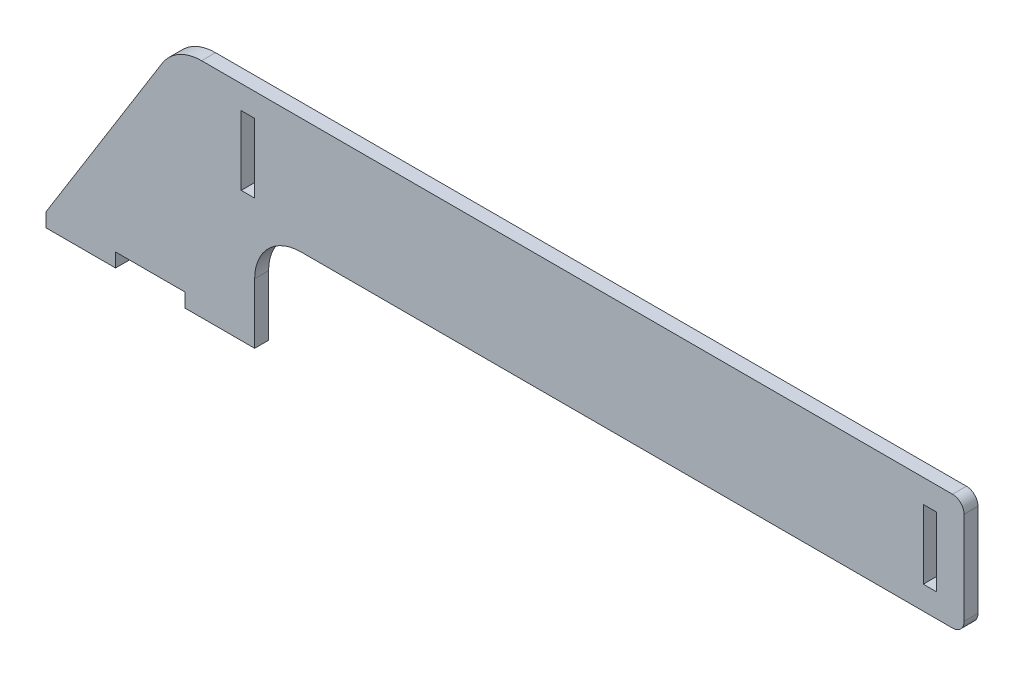
ISO-10303-21;
HEADER;
FILE_DESCRIPTION(('STEP AP214'),'2;1');
FILE_NAME('part.step','',(''),(''),'','','');
FILE_SCHEMA(('AUTOMOTIVE_DESIGN { 1 0 10303 214 1 1 1 1 }'));
ENDSEC;
DATA;
#1=APPLICATION_CONTEXT('core data for automotive mechanical design processes');
#2=APPLICATION_PROTOCOL_DEFINITION('international standard','automotive_design',2000,#1);
#3=PRODUCT_CONTEXT('',#1,'mechanical');
#4=PRODUCT('Part','Part','',(#3));
#5=PRODUCT_RELATED_PRODUCT_CATEGORY('part','',(#4));
#6=PRODUCT_DEFINITION_FORMATION('','',#4);
#7=PRODUCT_DEFINITION_CONTEXT('part definition',#1,'design');
#8=PRODUCT_DEFINITION('design','',#6,#7);
#9=PRODUCT_DEFINITION_SHAPE('','',#8);
#10=(LENGTH_UNIT() NAMED_UNIT(*) SI_UNIT(.MILLI.,.METRE.));
#11=(NAMED_UNIT(*) PLANE_ANGLE_UNIT() SI_UNIT($,.RADIAN.));
#12=(NAMED_UNIT(*) SI_UNIT($,.STERADIAN.) SOLID_ANGLE_UNIT());
#13=UNCERTAINTY_MEASURE_WITH_UNIT(LENGTH_MEASURE(1.E-05),#10,'distance_accuracy_value','');
#14=(GEOMETRIC_REPRESENTATION_CONTEXT(3) GLOBAL_UNCERTAINTY_ASSIGNED_CONTEXT((#13)) GLOBAL_UNIT_ASSIGNED_CONTEXT((#10,
#11,#12)) REPRESENTATION_CONTEXT('',''));
#15=CARTESIAN_POINT('',(0.,0.,0.));
#16=DIRECTION('',(0.,0.,1.));
#17=DIRECTION('',(1.,0.,0.));
#18=AXIS2_PLACEMENT_3D('',#15,#16,#17);
#19=CARTESIAN_POINT('',(0.,-40.,6.));
#20=DIRECTION('',(0.,1.,0.));
#21=DIRECTION('',(-1.,0.,0.));
#22=AXIS2_PLACEMENT_3D('',#19,#20,#21);
#23=PLANE('',#22);
#24=DIRECTION('',(0.,0.,-1.));
#25=VECTOR('',#24,1.);
#26=CARTESIAN_POINT('',(-30.,-40.,6.));
#27=LINE('',#26,#25);
#28=CARTESIAN_POINT('',(-30.,-40.,6.));
#29=VERTEX_POINT('',#28);
#30=CARTESIAN_POINT('',(-30.,-40.,0.));
#31=VERTEX_POINT('',#30);
#32=EDGE_CURVE('E265',#29,#31,#27,.T.);
#33=ORIENTED_EDGE('',*,*,#32,.F.);
#34=DIRECTION('',(1.,0.,0.));
#35=VECTOR('',#34,1.);
#36=CARTESIAN_POINT('',(0.,-40.,6.));
#37=LINE('',#36,#35);
#38=CARTESIAN_POINT('',(-60.,-40.,6.));
#39=VERTEX_POINT('',#38);
#40=EDGE_CURVE('E310',#39,#29,#37,.T.);
#41=ORIENTED_EDGE('',*,*,#40,.F.);
#42=DIRECTION('',(0.,0.,1.));
#43=VECTOR('',#42,1.);
#44=CARTESIAN_POINT('',(-60.,-40.,6.));
#45=LINE('',#44,#43);
#46=CARTESIAN_POINT('',(-60.,-40.,0.));
#47=VERTEX_POINT('',#46);
#48=EDGE_CURVE('E285',#47,#39,#45,.T.);
#49=ORIENTED_EDGE('',*,*,#48,.F.);
#50=DIRECTION('',(1.,0.,0.));
#51=VECTOR('',#50,1.);
#52=CARTESIAN_POINT('',(0.,-40.,0.));
#53=LINE('',#52,#51);
#54=EDGE_CURVE('E309',#47,#31,#53,.T.);
#55=ORIENTED_EDGE('',*,*,#54,.T.);
#56=EDGE_LOOP('',(#33,#41,#49,#55));
#57=FACE_BOUND('',#56,.T.);
#58=ADVANCED_FACE('F33',(#57),#23,.F.);
#59=CARTESIAN_POINT('',(0.,0.,6.));
#60=DIRECTION('',(-1.,0.,0.));
#61=DIRECTION('',(0.,-1.,0.));
#62=AXIS2_PLACEMENT_3D('',#59,#60,#61);
#63=PLANE('',#62);
#64=DIRECTION('',(0.,1.,0.));
#65=VECTOR('',#64,1.);
#66=CARTESIAN_POINT('',(0.,0.,0.));
#67=LINE('',#66,#65);
#68=CARTESIAN_POINT('',(0.,-46.,0.));
#69=VERTEX_POINT('',#68);
#70=CARTESIAN_POINT('',(0.,-20.,0.));
#71=VERTEX_POINT('',#70);
#72=EDGE_CURVE('E327',#69,#71,#67,.T.);
#73=ORIENTED_EDGE('',*,*,#72,.T.);
#74=DIRECTION('',(0.,0.,-1.));
#75=VECTOR('',#74,1.);
#76=CARTESIAN_POINT('',(0.,-20.,6.));
#77=LINE('',#76,#75);
#78=CARTESIAN_POINT('',(0.,-20.,6.));
#79=VERTEX_POINT('',#78);
#80=EDGE_CURVE('E354',#71,#79,#77,.F.);
#81=ORIENTED_EDGE('',*,*,#80,.T.);
#82=DIRECTION('',(0.,1.,0.));
#83=VECTOR('',#82,1.);
#84=CARTESIAN_POINT('',(0.,0.,6.));
#85=LINE('',#84,#83);
#86=CARTESIAN_POINT('',(0.,-46.,6.));
#87=VERTEX_POINT('',#86);
#88=EDGE_CURVE('E313',#87,#79,#85,.T.);
#89=ORIENTED_EDGE('',*,*,#88,.F.);
#90=DIRECTION('',(0.,0.,1.));
#91=VECTOR('',#90,1.);
#92=CARTESIAN_POINT('',(0.,-46.,6.));
#93=LINE('',#92,#91);
#94=EDGE_CURVE('E272',#69,#87,#93,.T.);
#95=ORIENTED_EDGE('',*,*,#94,.F.);
#96=EDGE_LOOP('',(#73,#81,#89,#95));
#97=FACE_BOUND('',#96,.T.);
#98=ADVANCED_FACE('F390',(#97),#63,.F.);
#99=CARTESIAN_POINT('',(306.,0.,6.));
#100=DIRECTION('',(0.,1.,0.));
#101=DIRECTION('',(-1.,0.,0.));
#102=AXIS2_PLACEMENT_3D('',#99,#100,#101);
#103=PLANE('',#102);
#104=DIRECTION('',(1.,0.,0.));
#105=VECTOR('',#104,1.);
#106=CARTESIAN_POINT('',(306.,0.,0.));
#107=LINE('',#106,#105);
#108=CARTESIAN_POINT('',(20.,0.,0.));
#109=VERTEX_POINT('',#108);
#110=CARTESIAN_POINT('',(301.,0.,0.));
#111=VERTEX_POINT('',#110);
#112=EDGE_CURVE('E330',#109,#111,#107,.T.);
#113=ORIENTED_EDGE('',*,*,#112,.T.);
#114=DIRECTION('',(0.,0.,-1.));
#115=VECTOR('',#114,1.);
#116=CARTESIAN_POINT('',(301.,0.,6.));
#117=LINE('',#116,#115);
#118=CARTESIAN_POINT('',(301.,0.,6.));
#119=VERTEX_POINT('',#118);
#120=EDGE_CURVE('E56',#111,#119,#117,.F.);
#121=ORIENTED_EDGE('',*,*,#120,.T.);
#122=DIRECTION('',(1.,0.,0.));
#123=VECTOR('',#122,1.);
#124=CARTESIAN_POINT('',(306.,0.,6.));
#125=LINE('',#124,#123);
#126=CARTESIAN_POINT('',(20.,0.,6.));
#127=VERTEX_POINT('',#126);
#128=EDGE_CURVE('E317',#127,#119,#125,.T.);
#129=ORIENTED_EDGE('',*,*,#128,.F.);
#130=DIRECTION('',(0.,0.,-1.));
#131=VECTOR('',#130,1.);
#132=CARTESIAN_POINT('',(20.,0.,0.));
#133=LINE('',#132,#131);
#134=EDGE_CURVE('E351',#127,#109,#133,.T.);
#135=ORIENTED_EDGE('',*,*,#134,.T.);
#136=EDGE_LOOP('',(#113,#121,#129,#135));
#137=FACE_BOUND('',#136,.T.);
#138=ADVANCED_FACE('F382',(#137),#103,.F.);
#139=CARTESIAN_POINT('',(306.,50.,6.));
#140=DIRECTION('',(-1.,0.,0.));
#141=DIRECTION('',(0.,0.,1.));
#142=AXIS2_PLACEMENT_3D('',#139,#140,#141);
#143=PLANE('',#142);
#144=DIRECTION('',(0.,1.,0.));
#145=VECTOR('',#144,1.);
#146=CARTESIAN_POINT('',(306.,50.,6.));
#147=LINE('',#146,#145);
#148=CARTESIAN_POINT('',(306.,5.00000000000002,6.));
#149=VERTEX_POINT('',#148);
#150=CARTESIAN_POINT('',(306.,45.,6.));
#151=VERTEX_POINT('',#150);
#152=EDGE_CURVE('E319',#149,#151,#147,.T.);
#153=ORIENTED_EDGE('',*,*,#152,.F.);
#154=DIRECTION('',(0.,0.,-1.));
#155=VECTOR('',#154,1.);
#156=CARTESIAN_POINT('',(306.,5.,6.));
#157=LINE('',#156,#155);
#158=CARTESIAN_POINT('',(306.,5.00000000000002,0.));
#159=VERTEX_POINT('',#158);
#160=EDGE_CURVE('E362',#149,#159,#157,.T.);
#161=ORIENTED_EDGE('',*,*,#160,.T.);
#162=DIRECTION('',(0.,1.,0.));
#163=VECTOR('',#162,1.);
#164=CARTESIAN_POINT('',(306.,50.,0.));
#165=LINE('',#164,#163);
#166=CARTESIAN_POINT('',(306.,45.,0.));
#167=VERTEX_POINT('',#166);
#168=EDGE_CURVE('E332',#159,#167,#165,.T.);
#169=ORIENTED_EDGE('',*,*,#168,.T.);
#170=DIRECTION('',(0.,0.,-1.));
#171=VECTOR('',#170,1.);
#172=CARTESIAN_POINT('',(306.,45.,6.));
#173=LINE('',#172,#171);
#174=EDGE_CURVE('E360',#167,#151,#173,.F.);
#175=ORIENTED_EDGE('',*,*,#174,.T.);
#176=EDGE_LOOP('',(#153,#161,#169,#175));
#177=FACE_BOUND('',#176,.T.);
#178=ADVANCED_FACE('F376',(#177),#143,.F.);
#179=CARTESIAN_POINT('',(-34.,50.,6.));
#180=DIRECTION('',(0.,-1.,0.));
#181=DIRECTION('',(0.,0.,-1.));
#182=AXIS2_PLACEMENT_3D('',#179,#180,#181);
#183=PLANE('',#182);
#184=DIRECTION('',(-1.,0.,0.));
#185=VECTOR('',#184,1.);
#186=CARTESIAN_POINT('',(-34.,50.,6.));
#187=LINE('',#186,#185);
#188=CARTESIAN_POINT('',(301.,50.,6.));
#189=VERTEX_POINT('',#188);
#190=CARTESIAN_POINT('',(-22.8888888888889,50.,6.));
#191=VERTEX_POINT('',#190);
#192=EDGE_CURVE('E321',#189,#191,#187,.T.);
#193=ORIENTED_EDGE('',*,*,#192,.F.);
#194=DIRECTION('',(0.,0.,-1.));
#195=VECTOR('',#194,1.);
#196=CARTESIAN_POINT('',(301.,50.,6.));
#197=LINE('',#196,#195);
#198=CARTESIAN_POINT('',(301.,50.,0.));
#199=VERTEX_POINT('',#198);
#200=EDGE_CURVE('E11',#189,#199,#197,.T.);
#201=ORIENTED_EDGE('',*,*,#200,.T.);
#202=DIRECTION('',(-1.,0.,0.));
#203=VECTOR('',#202,1.);
#204=CARTESIAN_POINT('',(-34.,50.,0.));
#205=LINE('',#204,#203);
#206=CARTESIAN_POINT('',(-22.8888888888889,50.,0.));
#207=VERTEX_POINT('',#206);
#208=EDGE_CURVE('E335',#199,#207,#205,.T.);
#209=ORIENTED_EDGE('',*,*,#208,.T.);
#210=DIRECTION('',(0.,0.,-1.));
#211=VECTOR('',#210,1.);
#212=CARTESIAN_POINT('',(-22.8888888888889,50.,6.));
#213=LINE('',#212,#211);
#214=EDGE_CURVE('E346',#207,#191,#213,.F.);
#215=ORIENTED_EDGE('',*,*,#214,.T.);
#216=EDGE_LOOP('',(#193,#201,#209,#215));
#217=FACE_BOUND('',#216,.T.);
#218=ADVANCED_FACE('F426',(#217),#183,.F.);
#219=CARTESIAN_POINT('',(-90.,-40.,6.));
#220=DIRECTION('',(0.849056603773585,-0.528301886792453,0.));
#221=DIRECTION('',(0.528301886792453,0.849056603773585,0.));
#222=AXIS2_PLACEMENT_3D('',#219,#220,#221);
#223=PLANE('',#222);
#224=DIRECTION('',(-0.528301886792452,-0.849056603773585,0.));
#225=VECTOR('',#224,1.);
#226=CARTESIAN_POINT('',(-90.,-40.,6.));
#227=LINE('',#226,#225);
#228=CARTESIAN_POINT('',(-39.8700209643606,40.5660377358491,6.));
#229=VERTEX_POINT('',#228);
#230=CARTESIAN_POINT('',(-90.,-40.,6.));
#231=VERTEX_POINT('',#230);
#232=EDGE_CURVE('E323',#229,#231,#227,.T.);
#233=ORIENTED_EDGE('',*,*,#232,.F.);
#234=DIRECTION('',(0.,0.,-1.));
#235=VECTOR('',#234,1.);
#236=CARTESIAN_POINT('',(-39.8700209643606,40.5660377358491,6.));
#237=LINE('',#236,#235);
#238=CARTESIAN_POINT('',(-39.8700209643606,40.5660377358491,0.));
#239=VERTEX_POINT('',#238);
#240=EDGE_CURVE('E340',#229,#239,#237,.T.);
#241=ORIENTED_EDGE('',*,*,#240,.T.);
#242=DIRECTION('',(-0.528301886792452,-0.849056603773585,0.));
#243=VECTOR('',#242,1.);
#244=CARTESIAN_POINT('',(-90.,-40.,0.));
#245=LINE('',#244,#243);
#246=CARTESIAN_POINT('',(-90.,-40.,0.));
#247=VERTEX_POINT('',#246);
#248=EDGE_CURVE('E314',#239,#247,#245,.T.);
#249=ORIENTED_EDGE('',*,*,#248,.T.);
#250=DIRECTION('',(0.,0.,-1.));
#251=VECTOR('',#250,1.);
#252=CARTESIAN_POINT('',(-90.,-40.,6.));
#253=LINE('',#252,#251);
#254=EDGE_CURVE('E325',#231,#247,#253,.T.);
#255=ORIENTED_EDGE('',*,*,#254,.F.);
#256=EDGE_LOOP('',(#233,#241,#249,#255));
#257=FACE_BOUND('',#256,.T.);
#258=ADVANCED_FACE('F418',(#257),#223,.F.);
#259=CARTESIAN_POINT('',(0.,0.,6.));
#260=DIRECTION('',(0.,0.,1.));
#261=DIRECTION('',(1.,0.,0.));
#262=AXIS2_PLACEMENT_3D('',#259,#260,#261);
#263=PLANE('',#262);
#264=DIRECTION('',(0.,-1.,0.));
#265=VECTOR('',#264,1.);
#266=CARTESIAN_POINT('',(288.4,39.9,6.));
#267=LINE('',#266,#265);
#268=CARTESIAN_POINT('',(288.4,39.9,6.));
#269=VERTEX_POINT('',#268);
#270=CARTESIAN_POINT('',(288.4,10.1,6.));
#271=VERTEX_POINT('',#270);
#272=EDGE_CURVE('E198',#269,#271,#267,.T.);
#273=ORIENTED_EDGE('',*,*,#272,.F.);
#274=DIRECTION('',(-1.,0.,0.));
#275=VECTOR('',#274,1.);
#276=CARTESIAN_POINT('',(288.4,39.9,6.));
#277=LINE('',#276,#275);
#278=CARTESIAN_POINT('',(294.2,39.9,6.));
#279=VERTEX_POINT('',#278);
#280=EDGE_CURVE('E203',#279,#269,#277,.T.);
#281=ORIENTED_EDGE('',*,*,#280,.F.);
#282=DIRECTION('',(0.,1.,0.));
#283=VECTOR('',#282,1.);
#284=CARTESIAN_POINT('',(294.2,39.9,6.));
#285=LINE('',#284,#283);
#286=CARTESIAN_POINT('',(294.2,10.1,6.));
#287=VERTEX_POINT('',#286);
#288=EDGE_CURVE('E226',#287,#279,#285,.T.);
#289=ORIENTED_EDGE('',*,*,#288,.F.);
#290=DIRECTION('',(1.,0.,0.));
#291=VECTOR('',#290,1.);
#292=CARTESIAN_POINT('',(288.4,10.1,6.));
#293=LINE('',#292,#291);
#294=EDGE_CURVE('E219',#271,#287,#293,.T.);
#295=ORIENTED_EDGE('',*,*,#294,.F.);
#296=EDGE_LOOP('',(#273,#281,#289,#295));
#297=FACE_BOUND('',#296,.T.);
#298=DIRECTION('',(0.,1.,0.));
#299=VECTOR('',#298,1.);
#300=CARTESIAN_POINT('',(0.,39.9,6.));
#301=LINE('',#300,#299);
#302=CARTESIAN_POINT('',(0.,10.1,6.));
#303=VERTEX_POINT('',#302);
#304=CARTESIAN_POINT('',(0.,39.9,6.));
#305=VERTEX_POINT('',#304);
#306=EDGE_CURVE('E242',#303,#305,#301,.T.);
#307=ORIENTED_EDGE('',*,*,#306,.F.);
#308=DIRECTION('',(1.,0.,0.));
#309=VECTOR('',#308,1.);
#310=CARTESIAN_POINT('',(0.,10.1,6.));
#311=LINE('',#310,#309);
#312=CARTESIAN_POINT('',(-5.8,10.1,6.));
#313=VERTEX_POINT('',#312);
#314=EDGE_CURVE('E250',#313,#303,#311,.T.);
#315=ORIENTED_EDGE('',*,*,#314,.F.);
#316=DIRECTION('',(0.,-1.,0.));
#317=VECTOR('',#316,1.);
#318=CARTESIAN_POINT('',(-5.8,39.9,6.));
#319=LINE('',#318,#317);
#320=CARTESIAN_POINT('',(-5.8,39.9,6.));
#321=VERTEX_POINT('',#320);
#322=EDGE_CURVE('E247',#321,#313,#319,.T.);
#323=ORIENTED_EDGE('',*,*,#322,.F.);
#324=DIRECTION('',(-1.,0.,0.));
#325=VECTOR('',#324,1.);
#326=CARTESIAN_POINT('',(0.,39.9,6.));
#327=LINE('',#326,#325);
#328=EDGE_CURVE('E244',#305,#321,#327,.T.);
#329=ORIENTED_EDGE('',*,*,#328,.F.);
#330=EDGE_LOOP('',(#307,#315,#323,#329));
#331=FACE_BOUND('',#330,.T.);
#332=ORIENTED_EDGE('',*,*,#128,.T.);
#333=CARTESIAN_POINT('',(301.,5.,6.));
#334=DIRECTION('',(0.,0.,1.));
#335=DIRECTION('',(1.,0.,0.));
#336=AXIS2_PLACEMENT_3D('',#333,#334,#335);
#337=CIRCLE('',#336,5.);
#338=EDGE_CURVE('E41',#119,#149,#337,.T.);
#339=ORIENTED_EDGE('',*,*,#338,.T.);
#340=ORIENTED_EDGE('',*,*,#152,.T.);
#341=CARTESIAN_POINT('',(301.,45.,6.));
#342=DIRECTION('',(0.,0.,1.));
#343=DIRECTION('',(1.,0.,0.));
#344=AXIS2_PLACEMENT_3D('',#341,#342,#343);
#345=CIRCLE('',#344,5.);
#346=EDGE_CURVE('E48',#151,#189,#345,.T.);
#347=ORIENTED_EDGE('',*,*,#346,.T.);
#348=ORIENTED_EDGE('',*,*,#192,.T.);
#349=CARTESIAN_POINT('',(-22.8888888888889,30.,6.));
#350=DIRECTION('',(0.,0.,1.));
#351=DIRECTION('',(1.,0.,0.));
#352=AXIS2_PLACEMENT_3D('',#349,#350,#351);
#353=CIRCLE('',#352,20.);
#354=EDGE_CURVE('E349',#191,#229,#353,.T.);
#355=ORIENTED_EDGE('',*,*,#354,.T.);
#356=ORIENTED_EDGE('',*,*,#232,.T.);
#357=DIRECTION('',(0.,1.,0.));
#358=VECTOR('',#357,1.);
#359=CARTESIAN_POINT('',(-90.,-46.,6.));
#360=LINE('',#359,#358);
#361=CARTESIAN_POINT('',(-90.,-46.,6.));
#362=VERTEX_POINT('',#361);
#363=EDGE_CURVE('E295',#362,#231,#360,.T.);
#364=ORIENTED_EDGE('',*,*,#363,.F.);
#365=DIRECTION('',(-1.,0.,0.));
#366=VECTOR('',#365,1.);
#367=CARTESIAN_POINT('',(-90.,-46.,6.));
#368=LINE('',#367,#366);
#369=CARTESIAN_POINT('',(-60.,-46.,6.));
#370=VERTEX_POINT('',#369);
#371=EDGE_CURVE('E293',#370,#362,#368,.T.);
#372=ORIENTED_EDGE('',*,*,#371,.F.);
#373=DIRECTION('',(0.,1.,0.));
#374=VECTOR('',#373,1.);
#375=CARTESIAN_POINT('',(-60.,-46.,6.));
#376=LINE('',#375,#374);
#377=EDGE_CURVE('E300',#370,#39,#376,.T.);
#378=ORIENTED_EDGE('',*,*,#377,.T.);
#379=ORIENTED_EDGE('',*,*,#40,.T.);
#380=DIRECTION('',(0.,1.,0.));
#381=VECTOR('',#380,1.);
#382=CARTESIAN_POINT('',(-30.,-46.,6.));
#383=LINE('',#382,#381);
#384=CARTESIAN_POINT('',(-30.,-46.,6.));
#385=VERTEX_POINT('',#384);
#386=EDGE_CURVE('E277',#385,#29,#383,.T.);
#387=ORIENTED_EDGE('',*,*,#386,.F.);
#388=DIRECTION('',(-1.,0.,0.));
#389=VECTOR('',#388,1.);
#390=CARTESIAN_POINT('',(-30.,-46.,6.));
#391=LINE('',#390,#389);
#392=EDGE_CURVE('E275',#87,#385,#391,.T.);
#393=ORIENTED_EDGE('',*,*,#392,.F.);
#394=ORIENTED_EDGE('',*,*,#88,.T.);
#395=CARTESIAN_POINT('',(20.,-20.,6.));
#396=DIRECTION('',(0.,0.,1.));
#397=DIRECTION('',(1.,0.,0.));
#398=AXIS2_PLACEMENT_3D('',#395,#396,#397);
#399=CIRCLE('',#398,20.);
#400=EDGE_CURVE('E358',#79,#127,#399,.F.);
#401=ORIENTED_EDGE('',*,*,#400,.T.);
#402=EDGE_LOOP('',(#332,#339,#340,#347,#348,#355,#356,#364,#372,#378,#379,#387,#393,#394,#401));
#403=FACE_BOUND('',#402,.T.);
#404=ADVANCED_FACE('F372',(#297,#331,#403),#263,.T.);
#405=CARTESIAN_POINT('',(0.,0.,0.));
#406=DIRECTION('',(0.,0.,1.));
#407=DIRECTION('',(1.,0.,0.));
#408=AXIS2_PLACEMENT_3D('',#405,#406,#407);
#409=PLANE('',#408);
#410=DIRECTION('',(1.,0.,0.));
#411=VECTOR('',#410,1.);
#412=CARTESIAN_POINT('',(288.4,39.9,0.));
#413=LINE('',#412,#411);
#414=CARTESIAN_POINT('',(288.4,39.9,0.));
#415=VERTEX_POINT('',#414);
#416=CARTESIAN_POINT('',(294.2,39.9,0.));
#417=VERTEX_POINT('',#416);
#418=EDGE_CURVE('E217',#415,#417,#413,.T.);
#419=ORIENTED_EDGE('',*,*,#418,.F.);
#420=DIRECTION('',(0.,1.,0.));
#421=VECTOR('',#420,1.);
#422=CARTESIAN_POINT('',(288.4,39.9,0.));
#423=LINE('',#422,#421);
#424=CARTESIAN_POINT('',(288.4,10.1,0.));
#425=VERTEX_POINT('',#424);
#426=EDGE_CURVE('E195',#425,#415,#423,.T.);
#427=ORIENTED_EDGE('',*,*,#426,.F.);
#428=DIRECTION('',(-1.,0.,0.));
#429=VECTOR('',#428,1.);
#430=CARTESIAN_POINT('',(288.4,10.1,0.));
#431=LINE('',#430,#429);
#432=CARTESIAN_POINT('',(294.2,10.1,0.));
#433=VERTEX_POINT('',#432);
#434=EDGE_CURVE('E207',#433,#425,#431,.T.);
#435=ORIENTED_EDGE('',*,*,#434,.F.);
#436=DIRECTION('',(0.,-1.,0.));
#437=VECTOR('',#436,1.);
#438=CARTESIAN_POINT('',(294.2,39.9,0.));
#439=LINE('',#438,#437);
#440=EDGE_CURVE('E221',#417,#433,#439,.T.);
#441=ORIENTED_EDGE('',*,*,#440,.F.);
#442=EDGE_LOOP('',(#419,#427,#435,#441));
#443=FACE_BOUND('',#442,.T.);
#444=DIRECTION('',(-1.,0.,0.));
#445=VECTOR('',#444,1.);
#446=CARTESIAN_POINT('',(0.,10.1,0.));
#447=LINE('',#446,#445);
#448=CARTESIAN_POINT('',(0.,10.1,0.));
#449=VERTEX_POINT('',#448);
#450=CARTESIAN_POINT('',(-5.8,10.1,0.));
#451=VERTEX_POINT('',#450);
#452=EDGE_CURVE('E236',#449,#451,#447,.T.);
#453=ORIENTED_EDGE('',*,*,#452,.F.);
#454=DIRECTION('',(0.,-1.,0.));
#455=VECTOR('',#454,1.);
#456=CARTESIAN_POINT('',(0.,39.9,0.));
#457=LINE('',#456,#455);
#458=CARTESIAN_POINT('',(0.,39.9,0.));
#459=VERTEX_POINT('',#458);
#460=EDGE_CURVE('E239',#459,#449,#457,.T.);
#461=ORIENTED_EDGE('',*,*,#460,.F.);
#462=DIRECTION('',(1.,0.,0.));
#463=VECTOR('',#462,1.);
#464=CARTESIAN_POINT('',(0.,39.9,0.));
#465=LINE('',#464,#463);
#466=CARTESIAN_POINT('',(-5.8,39.9,0.));
#467=VERTEX_POINT('',#466);
#468=EDGE_CURVE('E256',#467,#459,#465,.T.);
#469=ORIENTED_EDGE('',*,*,#468,.F.);
#470=DIRECTION('',(0.,1.,0.));
#471=VECTOR('',#470,1.);
#472=CARTESIAN_POINT('',(-5.8,39.9,0.));
#473=LINE('',#472,#471);
#474=EDGE_CURVE('E211',#451,#467,#473,.T.);
#475=ORIENTED_EDGE('',*,*,#474,.F.);
#476=EDGE_LOOP('',(#453,#461,#469,#475));
#477=FACE_BOUND('',#476,.T.);
#478=ORIENTED_EDGE('',*,*,#168,.F.);
#479=CARTESIAN_POINT('',(301.,5.,0.));
#480=DIRECTION('',(0.,0.,1.));
#481=DIRECTION('',(1.,0.,0.));
#482=AXIS2_PLACEMENT_3D('',#479,#480,#481);
#483=CIRCLE('',#482,5.);
#484=EDGE_CURVE('E367',#159,#111,#483,.F.);
#485=ORIENTED_EDGE('',*,*,#484,.T.);
#486=ORIENTED_EDGE('',*,*,#112,.F.);
#487=CARTESIAN_POINT('',(20.,-20.,0.));
#488=DIRECTION('',(0.,0.,1.));
#489=DIRECTION('',(1.,0.,0.));
#490=AXIS2_PLACEMENT_3D('',#487,#488,#489);
#491=CIRCLE('',#490,20.);
#492=EDGE_CURVE('E356',#109,#71,#491,.T.);
#493=ORIENTED_EDGE('',*,*,#492,.T.);
#494=ORIENTED_EDGE('',*,*,#72,.F.);
#495=DIRECTION('',(1.,0.,0.));
#496=VECTOR('',#495,1.);
#497=CARTESIAN_POINT('',(-30.,-46.,0.));
#498=LINE('',#497,#496);
#499=CARTESIAN_POINT('',(-30.,-46.,0.));
#500=VERTEX_POINT('',#499);
#501=EDGE_CURVE('E269',#500,#69,#498,.T.);
#502=ORIENTED_EDGE('',*,*,#501,.F.);
#503=DIRECTION('',(0.,1.,0.));
#504=VECTOR('',#503,1.);
#505=CARTESIAN_POINT('',(-30.,-46.,0.));
#506=LINE('',#505,#504);
#507=EDGE_CURVE('E282',#500,#31,#506,.T.);
#508=ORIENTED_EDGE('',*,*,#507,.T.);
#509=ORIENTED_EDGE('',*,*,#54,.F.);
#510=DIRECTION('',(0.,1.,0.));
#511=VECTOR('',#510,1.);
#512=CARTESIAN_POINT('',(-60.,-46.,0.));
#513=LINE('',#512,#511);
#514=CARTESIAN_POINT('',(-60.,-46.,0.));
#515=VERTEX_POINT('',#514);
#516=EDGE_CURVE('E303',#515,#47,#513,.T.);
#517=ORIENTED_EDGE('',*,*,#516,.F.);
#518=DIRECTION('',(1.,0.,0.));
#519=VECTOR('',#518,1.);
#520=CARTESIAN_POINT('',(-90.,-46.,0.));
#521=LINE('',#520,#519);
#522=CARTESIAN_POINT('',(-90.,-46.,0.));
#523=VERTEX_POINT('',#522);
#524=EDGE_CURVE('E289',#523,#515,#521,.T.);
#525=ORIENTED_EDGE('',*,*,#524,.F.);
#526=DIRECTION('',(0.,1.,0.));
#527=VECTOR('',#526,1.);
#528=CARTESIAN_POINT('',(-90.,-46.,0.));
#529=LINE('',#528,#527);
#530=EDGE_CURVE('E306',#523,#247,#529,.T.);
#531=ORIENTED_EDGE('',*,*,#530,.T.);
#532=ORIENTED_EDGE('',*,*,#248,.F.);
#533=CARTESIAN_POINT('',(-22.8888888888889,30.,0.));
#534=DIRECTION('',(0.,0.,1.));
#535=DIRECTION('',(1.,0.,0.));
#536=AXIS2_PLACEMENT_3D('',#533,#534,#535);
#537=CIRCLE('',#536,20.);
#538=EDGE_CURVE('E343',#239,#207,#537,.F.);
#539=ORIENTED_EDGE('',*,*,#538,.T.);
#540=ORIENTED_EDGE('',*,*,#208,.F.);
#541=CARTESIAN_POINT('',(301.,45.,0.));
#542=DIRECTION('',(0.,0.,1.));
#543=DIRECTION('',(1.,0.,0.));
#544=AXIS2_PLACEMENT_3D('',#541,#542,#543);
#545=CIRCLE('',#544,5.);
#546=EDGE_CURVE('E365',#199,#167,#545,.F.);
#547=ORIENTED_EDGE('',*,*,#546,.T.);
#548=EDGE_LOOP('',(#478,#485,#486,#493,#494,#502,#508,#509,#517,#525,#531,#532,#539,#540,#547));
#549=FACE_BOUND('',#548,.T.);
#550=ADVANCED_FACE('F214',(#443,#477,#549),#409,.F.);
#551=CARTESIAN_POINT('',(-90.,-46.,6.));
#552=DIRECTION('',(1.,0.,0.));
#553=DIRECTION('',(0.,1.,0.));
#554=AXIS2_PLACEMENT_3D('',#551,#552,#553);
#555=PLANE('',#554);
#556=ORIENTED_EDGE('',*,*,#254,.T.);
#557=ORIENTED_EDGE('',*,*,#530,.F.);
#558=DIRECTION('',(0.,0.,-1.));
#559=VECTOR('',#558,1.);
#560=CARTESIAN_POINT('',(-90.,-46.,6.));
#561=LINE('',#560,#559);
#562=EDGE_CURVE('E286',#362,#523,#561,.T.);
#563=ORIENTED_EDGE('',*,*,#562,.F.);
#564=ORIENTED_EDGE('',*,*,#363,.T.);
#565=EDGE_LOOP('',(#556,#557,#563,#564));
#566=FACE_BOUND('',#565,.T.);
#567=ADVANCED_FACE('F415',(#566),#555,.F.);
#568=CARTESIAN_POINT('',(-60.,-46.,6.));
#569=DIRECTION('',(-1.,0.,0.));
#570=DIRECTION('',(0.,-1.,0.));
#571=AXIS2_PLACEMENT_3D('',#568,#569,#570);
#572=PLANE('',#571);
#573=ORIENTED_EDGE('',*,*,#48,.T.);
#574=ORIENTED_EDGE('',*,*,#377,.F.);
#575=DIRECTION('',(0.,0.,1.));
#576=VECTOR('',#575,1.);
#577=CARTESIAN_POINT('',(-60.,-46.,6.));
#578=LINE('',#577,#576);
#579=EDGE_CURVE('E291',#515,#370,#578,.T.);
#580=ORIENTED_EDGE('',*,*,#579,.F.);
#581=ORIENTED_EDGE('',*,*,#516,.T.);
#582=EDGE_LOOP('',(#573,#574,#580,#581));
#583=FACE_BOUND('',#582,.T.);
#584=ADVANCED_FACE('F404',(#583),#572,.F.);
#585=CARTESIAN_POINT('',(0.,-46.,0.));
#586=DIRECTION('',(0.,-1.,0.));
#587=DIRECTION('',(1.,0.,0.));
#588=AXIS2_PLACEMENT_3D('',#585,#586,#587);
#589=PLANE('',#588);
#590=ORIENTED_EDGE('',*,*,#562,.T.);
#591=ORIENTED_EDGE('',*,*,#524,.T.);
#592=ORIENTED_EDGE('',*,*,#579,.T.);
#593=ORIENTED_EDGE('',*,*,#371,.T.);
#594=EDGE_LOOP('',(#590,#591,#592,#593));
#595=FACE_BOUND('',#594,.T.);
#596=ADVANCED_FACE('F408',(#595),#589,.T.);
#597=CARTESIAN_POINT('',(-30.,-46.,6.));
#598=DIRECTION('',(1.,0.,0.));
#599=DIRECTION('',(0.,1.,0.));
#600=AXIS2_PLACEMENT_3D('',#597,#598,#599);
#601=PLANE('',#600);
#602=ORIENTED_EDGE('',*,*,#32,.T.);
#603=ORIENTED_EDGE('',*,*,#507,.F.);
#604=DIRECTION('',(0.,0.,-1.));
#605=VECTOR('',#604,1.);
#606=CARTESIAN_POINT('',(-30.,-46.,6.));
#607=LINE('',#606,#605);
#608=EDGE_CURVE('E266',#385,#500,#607,.T.);
#609=ORIENTED_EDGE('',*,*,#608,.F.);
#610=ORIENTED_EDGE('',*,*,#386,.T.);
#611=EDGE_LOOP('',(#602,#603,#609,#610));
#612=FACE_BOUND('',#611,.T.);
#613=ADVANCED_FACE('F398',(#612),#601,.F.);
#614=CARTESIAN_POINT('',(0.,-46.,0.));
#615=DIRECTION('',(0.,-1.,0.));
#616=DIRECTION('',(1.,0.,0.));
#617=AXIS2_PLACEMENT_3D('',#614,#615,#616);
#618=PLANE('',#617);
#619=ORIENTED_EDGE('',*,*,#608,.T.);
#620=ORIENTED_EDGE('',*,*,#501,.T.);
#621=ORIENTED_EDGE('',*,*,#94,.T.);
#622=ORIENTED_EDGE('',*,*,#392,.T.);
#623=EDGE_LOOP('',(#619,#620,#621,#622));
#624=FACE_BOUND('',#623,.T.);
#625=ADVANCED_FACE('F393',(#624),#618,.T.);
#626=CARTESIAN_POINT('',(0.,39.9,-0.00100000000000013));
#627=DIRECTION('',(1.,0.,0.));
#628=DIRECTION('',(0.,0.,-1.));
#629=AXIS2_PLACEMENT_3D('',#626,#627,#628);
#630=PLANE('',#629);
#631=ORIENTED_EDGE('',*,*,#460,.T.);
#632=DIRECTION('',(0.,0.,1.));
#633=VECTOR('',#632,1.);
#634=CARTESIAN_POINT('',(0.,10.1,-0.00100000000000013));
#635=LINE('',#634,#633);
#636=EDGE_CURVE('E254',#449,#303,#635,.T.);
#637=ORIENTED_EDGE('',*,*,#636,.T.);
#638=ORIENTED_EDGE('',*,*,#306,.T.);
#639=DIRECTION('',(0.,0.,1.));
#640=VECTOR('',#639,1.);
#641=CARTESIAN_POINT('',(0.,39.9,-0.00100000000000013));
#642=LINE('',#641,#640);
#643=EDGE_CURVE('E253',#459,#305,#642,.T.);
#644=ORIENTED_EDGE('',*,*,#643,.F.);
#645=EDGE_LOOP('',(#631,#637,#638,#644));
#646=FACE_BOUND('',#645,.T.);
#647=ADVANCED_FACE('F584',(#646),#630,.F.);
#648=CARTESIAN_POINT('',(0.,10.1,-0.00100000000000013));
#649=DIRECTION('',(0.,-1.,0.));
#650=DIRECTION('',(0.,0.,-1.));
#651=AXIS2_PLACEMENT_3D('',#648,#649,#650);
#652=PLANE('',#651);
#653=ORIENTED_EDGE('',*,*,#452,.T.);
#654=DIRECTION('',(0.,0.,1.));
#655=VECTOR('',#654,1.);
#656=CARTESIAN_POINT('',(-5.8,10.1,-0.00100000000000013));
#657=LINE('',#656,#655);
#658=EDGE_CURVE('E257',#451,#313,#657,.T.);
#659=ORIENTED_EDGE('',*,*,#658,.T.);
#660=ORIENTED_EDGE('',*,*,#314,.T.);
#661=ORIENTED_EDGE('',*,*,#636,.F.);
#662=EDGE_LOOP('',(#653,#659,#660,#661));
#663=FACE_BOUND('',#662,.T.);
#664=ADVANCED_FACE('F575',(#663),#652,.F.);
#665=CARTESIAN_POINT('',(-5.8,39.9,-0.00100000000000013));
#666=DIRECTION('',(-1.,0.,0.));
#667=DIRECTION('',(0.,0.,1.));
#668=AXIS2_PLACEMENT_3D('',#665,#666,#667);
#669=PLANE('',#668);
#670=ORIENTED_EDGE('',*,*,#474,.T.);
#671=DIRECTION('',(0.,0.,1.));
#672=VECTOR('',#671,1.);
#673=CARTESIAN_POINT('',(-5.8,39.9,-0.00100000000000013));
#674=LINE('',#673,#672);
#675=EDGE_CURVE('E259',#467,#321,#674,.T.);
#676=ORIENTED_EDGE('',*,*,#675,.T.);
#677=ORIENTED_EDGE('',*,*,#322,.T.);
#678=ORIENTED_EDGE('',*,*,#658,.F.);
#679=EDGE_LOOP('',(#670,#676,#677,#678));
#680=FACE_BOUND('',#679,.T.);
#681=ADVANCED_FACE('F566',(#680),#669,.F.);
#682=CARTESIAN_POINT('',(0.,39.9,-0.00100000000000013));
#683=DIRECTION('',(0.,1.,0.));
#684=DIRECTION('',(0.,0.,1.));
#685=AXIS2_PLACEMENT_3D('',#682,#683,#684);
#686=PLANE('',#685);
#687=ORIENTED_EDGE('',*,*,#468,.T.);
#688=ORIENTED_EDGE('',*,*,#643,.T.);
#689=ORIENTED_EDGE('',*,*,#328,.T.);
#690=ORIENTED_EDGE('',*,*,#675,.F.);
#691=EDGE_LOOP('',(#687,#688,#689,#690));
#692=FACE_BOUND('',#691,.T.);
#693=ADVANCED_FACE('F558',(#692),#686,.F.);
#694=CARTESIAN_POINT('',(288.4,39.9,-0.00100000000000013));
#695=DIRECTION('',(-1.,0.,0.));
#696=DIRECTION('',(0.,0.,1.));
#697=AXIS2_PLACEMENT_3D('',#694,#695,#696);
#698=PLANE('',#697);
#699=ORIENTED_EDGE('',*,*,#426,.T.);
#700=DIRECTION('',(0.,0.,1.));
#701=VECTOR('',#700,1.);
#702=CARTESIAN_POINT('',(288.4,39.9,-0.00100000000000013));
#703=LINE('',#702,#701);
#704=EDGE_CURVE('E212',#415,#269,#703,.T.);
#705=ORIENTED_EDGE('',*,*,#704,.T.);
#706=ORIENTED_EDGE('',*,*,#272,.T.);
#707=DIRECTION('',(0.,0.,1.));
#708=VECTOR('',#707,1.);
#709=CARTESIAN_POINT('',(288.4,10.1,-0.00100000000000013));
#710=LINE('',#709,#708);
#711=EDGE_CURVE('E191',#425,#271,#710,.T.);
#712=ORIENTED_EDGE('',*,*,#711,.F.);
#713=EDGE_LOOP('',(#699,#705,#706,#712));
#714=FACE_BOUND('',#713,.T.);
#715=ADVANCED_FACE('F193',(#714),#698,.F.);
#716=CARTESIAN_POINT('',(288.4,39.9,-0.00100000000000013));
#717=DIRECTION('',(0.,1.,0.));
#718=DIRECTION('',(0.,0.,1.));
#719=AXIS2_PLACEMENT_3D('',#716,#717,#718);
#720=PLANE('',#719);
#721=ORIENTED_EDGE('',*,*,#418,.T.);
#722=DIRECTION('',(0.,0.,1.));
#723=VECTOR('',#722,1.);
#724=CARTESIAN_POINT('',(294.2,39.9,-0.00100000000000013));
#725=LINE('',#724,#723);
#726=EDGE_CURVE('E232',#417,#279,#725,.T.);
#727=ORIENTED_EDGE('',*,*,#726,.T.);
#728=ORIENTED_EDGE('',*,*,#280,.T.);
#729=ORIENTED_EDGE('',*,*,#704,.F.);
#730=EDGE_LOOP('',(#721,#727,#728,#729));
#731=FACE_BOUND('',#730,.T.);
#732=ADVANCED_FACE('F541',(#731),#720,.F.);
#733=CARTESIAN_POINT('',(294.2,39.9,-0.00100000000000013));
#734=DIRECTION('',(1.,0.,0.));
#735=DIRECTION('',(0.,0.,-1.));
#736=AXIS2_PLACEMENT_3D('',#733,#734,#735);
#737=PLANE('',#736);
#738=ORIENTED_EDGE('',*,*,#440,.T.);
#739=DIRECTION('',(0.,0.,1.));
#740=VECTOR('',#739,1.);
#741=CARTESIAN_POINT('',(294.2,10.1,-0.00100000000000013));
#742=LINE('',#741,#740);
#743=EDGE_CURVE('E202',#433,#287,#742,.T.);
#744=ORIENTED_EDGE('',*,*,#743,.T.);
#745=ORIENTED_EDGE('',*,*,#288,.T.);
#746=ORIENTED_EDGE('',*,*,#726,.F.);
#747=EDGE_LOOP('',(#738,#744,#745,#746));
#748=FACE_BOUND('',#747,.T.);
#749=ADVANCED_FACE('F535',(#748),#737,.F.);
#750=CARTESIAN_POINT('',(288.4,10.1,-0.00100000000000013));
#751=DIRECTION('',(0.,-1.,0.));
#752=DIRECTION('',(0.,0.,-1.));
#753=AXIS2_PLACEMENT_3D('',#750,#751,#752);
#754=PLANE('',#753);
#755=ORIENTED_EDGE('',*,*,#434,.T.);
#756=ORIENTED_EDGE('',*,*,#711,.T.);
#757=ORIENTED_EDGE('',*,*,#294,.T.);
#758=ORIENTED_EDGE('',*,*,#743,.F.);
#759=EDGE_LOOP('',(#755,#756,#757,#758));
#760=FACE_BOUND('',#759,.T.);
#761=ADVANCED_FACE('F208',(#760),#754,.F.);
#762=CARTESIAN_POINT('',(-22.8888888888889,30.,6.));
#763=DIRECTION('',(0.,0.,-1.));
#764=DIRECTION('',(-1.,0.,0.));
#765=AXIS2_PLACEMENT_3D('',#762,#763,#764);
#766=CYLINDRICAL_SURFACE('',#765,20.);
#767=ORIENTED_EDGE('',*,*,#354,.F.);
#768=ORIENTED_EDGE('',*,*,#214,.F.);
#769=ORIENTED_EDGE('',*,*,#538,.F.);
#770=ORIENTED_EDGE('',*,*,#240,.F.);
#771=EDGE_LOOP('',(#767,#768,#769,#770));
#772=FACE_BOUND('',#771,.T.);
#773=ADVANCED_FACE('F422',(#772),#766,.T.);
#774=CARTESIAN_POINT('',(20.,-20.,6.));
#775=DIRECTION('',(0.,0.,1.));
#776=DIRECTION('',(1.,0.,0.));
#777=AXIS2_PLACEMENT_3D('',#774,#775,#776);
#778=CYLINDRICAL_SURFACE('',#777,20.);
#779=ORIENTED_EDGE('',*,*,#400,.F.);
#780=ORIENTED_EDGE('',*,*,#80,.F.);
#781=ORIENTED_EDGE('',*,*,#492,.F.);
#782=ORIENTED_EDGE('',*,*,#134,.F.);
#783=EDGE_LOOP('',(#779,#780,#781,#782));
#784=FACE_BOUND('',#783,.T.);
#785=ADVANCED_FACE('F386',(#784),#778,.F.);
#786=CARTESIAN_POINT('',(301.,5.,6.));
#787=DIRECTION('',(0.,0.,-1.));
#788=DIRECTION('',(-1.,0.,0.));
#789=AXIS2_PLACEMENT_3D('',#786,#787,#788);
#790=CYLINDRICAL_SURFACE('',#789,5.);
#791=ORIENTED_EDGE('',*,*,#338,.F.);
#792=ORIENTED_EDGE('',*,*,#120,.F.);
#793=ORIENTED_EDGE('',*,*,#484,.F.);
#794=ORIENTED_EDGE('',*,*,#160,.F.);
#795=EDGE_LOOP('',(#791,#792,#793,#794));
#796=FACE_BOUND('',#795,.T.);
#797=ADVANCED_FACE('F379',(#796),#790,.T.);
#798=CARTESIAN_POINT('',(301.,45.,6.));
#799=DIRECTION('',(0.,0.,-1.));
#800=DIRECTION('',(-1.,0.,0.));
#801=AXIS2_PLACEMENT_3D('',#798,#799,#800);
#802=CYLINDRICAL_SURFACE('',#801,5.);
#803=ORIENTED_EDGE('',*,*,#346,.F.);
#804=ORIENTED_EDGE('',*,*,#174,.F.);
#805=ORIENTED_EDGE('',*,*,#546,.F.);
#806=ORIENTED_EDGE('',*,*,#200,.F.);
#807=EDGE_LOOP('',(#803,#804,#805,#806));
#808=FACE_BOUND('',#807,.T.);
#809=ADVANCED_FACE('F35',(#808),#802,.T.);
#810=CLOSED_SHELL('',(#58,#98,#138,#178,#218,#258,#404,#550,#567,#584,#596,#613,#625,#647,#664,
#681,#693,#715,#732,#749,#761,#773,#785,#797,#809));
#811=MANIFOLD_SOLID_BREP('B2',#810);
#812=ADVANCED_BREP_SHAPE_REPRESENTATION('',(#18,#811),#14);
#813=SHAPE_DEFINITION_REPRESENTATION(#9,#812);
ENDSEC;
END-ISO-10303-21;
